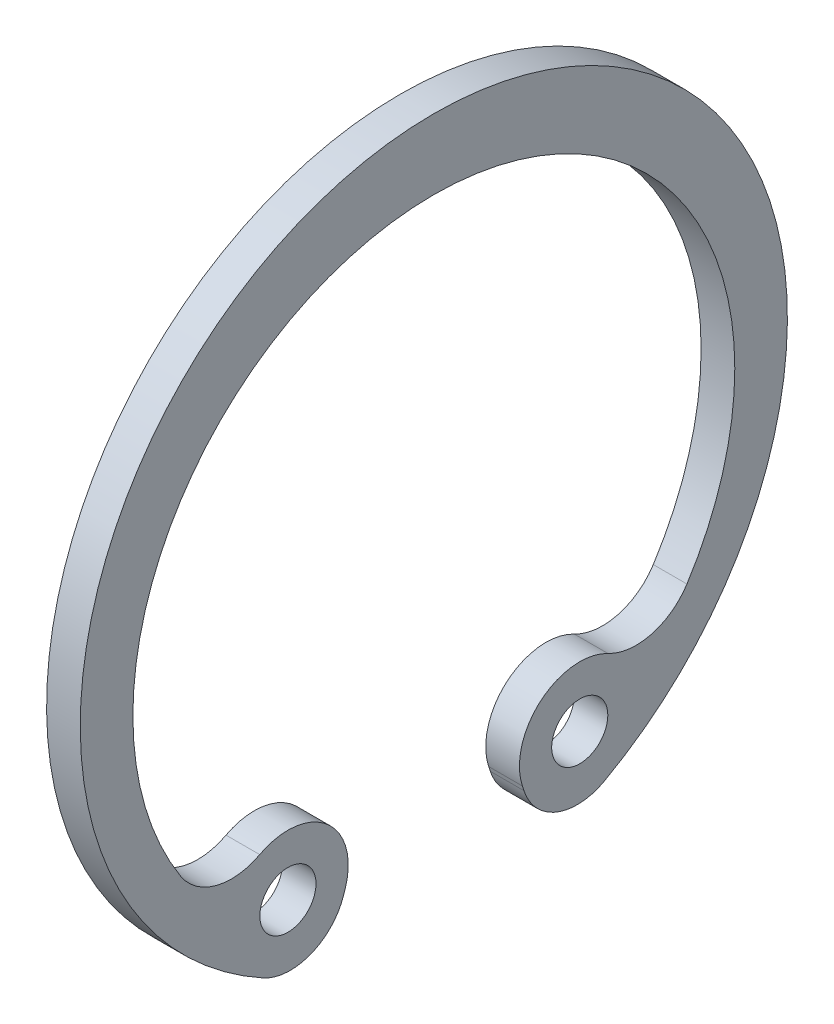
ISO-10303-21;
HEADER;
FILE_DESCRIPTION(('STEP AP214'),'2;1');
FILE_NAME('part.step','',(''),(''),'','','');
FILE_SCHEMA(('AUTOMOTIVE_DESIGN { 1 0 10303 214 1 1 1 1 }'));
ENDSEC;
DATA;
#1=APPLICATION_CONTEXT('core data for automotive mechanical design processes');
#2=APPLICATION_PROTOCOL_DEFINITION('international standard','automotive_design',2000,#1);
#3=PRODUCT_CONTEXT('',#1,'mechanical');
#4=PRODUCT('Part','Part','',(#3));
#5=PRODUCT_RELATED_PRODUCT_CATEGORY('part','',(#4));
#6=PRODUCT_DEFINITION_FORMATION('','',#4);
#7=PRODUCT_DEFINITION_CONTEXT('part definition',#1,'design');
#8=PRODUCT_DEFINITION('design','',#6,#7);
#9=PRODUCT_DEFINITION_SHAPE('','',#8);
#10=(LENGTH_UNIT() NAMED_UNIT(*) SI_UNIT(.MILLI.,.METRE.));
#11=(NAMED_UNIT(*) PLANE_ANGLE_UNIT() SI_UNIT($,.RADIAN.));
#12=(NAMED_UNIT(*) SI_UNIT($,.STERADIAN.) SOLID_ANGLE_UNIT());
#13=UNCERTAINTY_MEASURE_WITH_UNIT(LENGTH_MEASURE(1.E-05),#10,'distance_accuracy_value','');
#14=(GEOMETRIC_REPRESENTATION_CONTEXT(3) GLOBAL_UNCERTAINTY_ASSIGNED_CONTEXT((#13)) GLOBAL_UNIT_ASSIGNED_CONTEXT((#10,
#11,#12)) REPRESENTATION_CONTEXT('',''));
#15=CARTESIAN_POINT('',(0.,0.,0.));
#16=DIRECTION('',(0.,0.,1.));
#17=DIRECTION('',(1.,0.,0.));
#18=AXIS2_PLACEMENT_3D('',#15,#16,#17);
#19=CARTESIAN_POINT('',(-0.6,-9.28486852547096,-5.11382601040736));
#20=DIRECTION('',(1.,0.,0.));
#21=DIRECTION('',(0.,0.,-1.));
#22=AXIS2_PLACEMENT_3D('',#19,#20,#21);
#23=PLANE('',#22);
#24=DIRECTION('',(0.,-0.951223932313358,-0.308501265142158));
#25=VECTOR('',#24,1.);
#26=CARTESIAN_POINT('',(-0.6,-9.72763097883804,-3.15486854552626));
#27=LINE('',#26,#25);
#28=CARTESIAN_POINT('',(-0.6,-9.72763097883807,-3.15486854552627));
#29=VERTEX_POINT('',#28);
#30=CARTESIAN_POINT('',(-0.6,-9.90187105575525,-3.21137814578064));
#31=VERTEX_POINT('',#30);
#32=EDGE_CURVE('E90',#29,#31,#27,.T.);
#33=ORIENTED_EDGE('',*,*,#32,.F.);
#34=CARTESIAN_POINT('',(-0.6,-9.06435325878245,-5.2));
#35=DIRECTION('',(1.,0.,0.));
#36=DIRECTION('',(0.,0.,-1.));
#37=AXIS2_PLACEMENT_3D('',#34,#35,#36);
#38=CIRCLE('',#37,2.15);
#39=CARTESIAN_POINT('',(-0.6,-7.16418116422213,-6.20590556766242));
#40=VERTEX_POINT('',#39);
#41=EDGE_CURVE('E121',#40,#29,#38,.T.);
#42=ORIENTED_EDGE('',*,*,#41,.F.);
#43=CARTESIAN_POINT('',(-0.6,-5.26400906966182,-7.21181113532484));
#44=DIRECTION('',(1.,0.,0.));
#45=DIRECTION('',(0.,0.,-1.));
#46=AXIS2_PLACEMENT_3D('',#43,#44,#45);
#47=CIRCLE('',#46,2.15);
#48=CARTESIAN_POINT('',(-0.6,-6.42714253902309,-9.02002034126635));
#49=VERTEX_POINT('',#48);
#50=EDGE_CURVE('E124',#40,#49,#47,.T.);
#51=ORIENTED_EDGE('',*,*,#50,.T.);
#52=CARTESIAN_POINT('',(-0.6,-0.625000000000004,0.));
#53=DIRECTION('',(1.,0.,0.));
#54=DIRECTION('',(0.,0.,-1.));
#55=AXIS2_PLACEMENT_3D('',#52,#53,#54);
#56=CIRCLE('',#55,10.725);
#57=CARTESIAN_POINT('',(-0.6,-6.42714253902309,9.02002034126636));
#58=VERTEX_POINT('',#57);
#59=EDGE_CURVE('E125',#49,#58,#56,.T.);
#60=ORIENTED_EDGE('',*,*,#59,.T.);
#61=CARTESIAN_POINT('',(-0.6,-5.26400906966182,7.21181113532485));
#62=DIRECTION('',(1.,0.,0.));
#63=DIRECTION('',(0.,0.,-1.));
#64=AXIS2_PLACEMENT_3D('',#61,#62,#63);
#65=CIRCLE('',#64,2.15);
#66=CARTESIAN_POINT('',(-0.6,-7.16418117408161,6.20590558628714));
#67=VERTEX_POINT('',#66);
#68=EDGE_CURVE('E128',#58,#67,#65,.T.);
#69=ORIENTED_EDGE('',*,*,#68,.T.);
#70=CARTESIAN_POINT('',(-0.6,-9.06435325878245,5.2));
#71=DIRECTION('',(1.,0.,0.));
#72=DIRECTION('',(0.,0.,-1.));
#73=AXIS2_PLACEMENT_3D('',#70,#71,#72);
#74=CIRCLE('',#73,2.15);
#75=CARTESIAN_POINT('',(-0.6,-9.72763097883802,3.15486854552626));
#76=VERTEX_POINT('',#75);
#77=EDGE_CURVE('E134',#76,#67,#74,.T.);
#78=ORIENTED_EDGE('',*,*,#77,.F.);
#79=DIRECTION('',(0.,-0.951223932313369,0.308501265142123));
#80=VECTOR('',#79,1.);
#81=CARTESIAN_POINT('',(-0.6,-9.9018710557552,3.21137814578062));
#82=LINE('',#81,#80);
#83=CARTESIAN_POINT('',(-0.6,-9.9018710557552,3.21137814578062));
#84=VERTEX_POINT('',#83);
#85=EDGE_CURVE('E137',#76,#84,#82,.T.);
#86=ORIENTED_EDGE('',*,*,#85,.T.);
#87=CARTESIAN_POINT('',(-0.6,-9.28486852547096,5.11382601040736));
#88=DIRECTION('',(1.,0.,0.));
#89=DIRECTION('',(0.,0.,-1.));
#90=AXIS2_PLACEMENT_3D('',#87,#88,#89);
#91=CIRCLE('',#90,2.);
#92=CARTESIAN_POINT('',(-0.6,-11.0367305114089,6.07869884255969));
#93=VERTEX_POINT('',#92);
#94=EDGE_CURVE('E141',#93,#84,#91,.T.);
#95=ORIENTED_EDGE('',*,*,#94,.F.);
#96=CARTESIAN_POINT('',(-0.6,0.,0.));
#97=DIRECTION('',(1.,0.,0.));
#98=DIRECTION('',(0.,0.,-1.));
#99=AXIS2_PLACEMENT_3D('',#96,#97,#98);
#100=CIRCLE('',#99,12.6);
#101=CARTESIAN_POINT('',(-0.6,-11.0367304792593,-6.07869890093175));
#102=VERTEX_POINT('',#101);
#103=EDGE_CURVE('E102',#102,#93,#100,.T.);
#104=ORIENTED_EDGE('',*,*,#103,.F.);
#105=CARTESIAN_POINT('',(-0.6,-9.28486852547096,-5.11382601040736));
#106=DIRECTION('',(1.,0.,0.));
#107=DIRECTION('',(0.,0.,-1.));
#108=AXIS2_PLACEMENT_3D('',#105,#106,#107);
#109=CIRCLE('',#108,2.);
#110=EDGE_CURVE('E99',#31,#102,#109,.T.);
#111=ORIENTED_EDGE('',*,*,#110,.F.);
#112=EDGE_LOOP('',(#33,#42,#51,#60,#69,#78,#86,#95,#104,#111));
#113=FACE_BOUND('',#112,.T.);
#114=CARTESIAN_POINT('',(-0.6,-9.06435325878246,-5.2));
#115=DIRECTION('',(1.,0.,0.));
#116=DIRECTION('',(0.,0.,-1.));
#117=AXIS2_PLACEMENT_3D('',#114,#115,#116);
#118=CIRCLE('',#117,1.);
#119=CARTESIAN_POINT('',(-0.6,-9.06435325878246,-6.2));
#120=VERTEX_POINT('',#119);
#121=EDGE_CURVE('E105',#120,#120,#118,.T.);
#122=ORIENTED_EDGE('',*,*,#121,.T.);
#123=EDGE_LOOP('',(#122));
#124=FACE_BOUND('',#123,.T.);
#125=CARTESIAN_POINT('',(-0.6,-9.06435325878245,5.2));
#126=DIRECTION('',(1.,0.,0.));
#127=DIRECTION('',(0.,0.,-1.));
#128=AXIS2_PLACEMENT_3D('',#125,#126,#127);
#129=CIRCLE('',#128,1.);
#130=CARTESIAN_POINT('',(-0.6,-9.06435325878245,4.2));
#131=VERTEX_POINT('',#130);
#132=EDGE_CURVE('E19',#131,#131,#129,.T.);
#133=ORIENTED_EDGE('',*,*,#132,.T.);
#134=EDGE_LOOP('',(#133));
#135=FACE_BOUND('',#134,.T.);
#136=ADVANCED_FACE('F16',(#113,#124,#135),#23,.F.);
#137=CARTESIAN_POINT('',(0.6,-9.06435325878245,5.2));
#138=DIRECTION('',(1.,0.,0.));
#139=DIRECTION('',(0.,0.,-1.));
#140=AXIS2_PLACEMENT_3D('',#137,#138,#139);
#141=CYLINDRICAL_SURFACE('',#140,1.);
#142=ORIENTED_EDGE('',*,*,#132,.F.);
#143=EDGE_LOOP('',(#142));
#144=FACE_BOUND('',#143,.T.);
#145=CARTESIAN_POINT('',(0.6,-9.06435325878245,5.2));
#146=DIRECTION('',(1.,0.,0.));
#147=DIRECTION('',(0.,0.,-1.));
#148=AXIS2_PLACEMENT_3D('',#145,#146,#147);
#149=CIRCLE('',#148,1.);
#150=CARTESIAN_POINT('',(0.6,-9.06435325878245,4.2));
#151=VERTEX_POINT('',#150);
#152=EDGE_CURVE('E110',#151,#151,#149,.F.);
#153=ORIENTED_EDGE('',*,*,#152,.F.);
#154=EDGE_LOOP('',(#153));
#155=FACE_BOUND('',#154,.T.);
#156=ADVANCED_FACE('F185',(#144,#155),#141,.F.);
#157=CARTESIAN_POINT('',(0.6,-9.06435325878246,-5.2));
#158=DIRECTION('',(1.,0.,0.));
#159=DIRECTION('',(0.,0.,-1.));
#160=AXIS2_PLACEMENT_3D('',#157,#158,#159);
#161=CYLINDRICAL_SURFACE('',#160,1.);
#162=ORIENTED_EDGE('',*,*,#121,.F.);
#163=EDGE_LOOP('',(#162));
#164=FACE_BOUND('',#163,.T.);
#165=CARTESIAN_POINT('',(0.6,-9.06435325878246,-5.2));
#166=DIRECTION('',(1.,0.,0.));
#167=DIRECTION('',(0.,0.,-1.));
#168=AXIS2_PLACEMENT_3D('',#165,#166,#167);
#169=CIRCLE('',#168,1.);
#170=CARTESIAN_POINT('',(0.6,-9.06435325878246,-6.2));
#171=VERTEX_POINT('',#170);
#172=EDGE_CURVE('E113',#171,#171,#169,.F.);
#173=ORIENTED_EDGE('',*,*,#172,.F.);
#174=EDGE_LOOP('',(#173));
#175=FACE_BOUND('',#174,.T.);
#176=ADVANCED_FACE('F188',(#164,#175),#161,.F.);
#177=CARTESIAN_POINT('',(0.6,-9.28486852547096,-5.11382601040736));
#178=DIRECTION('',(1.,0.,0.));
#179=DIRECTION('',(0.,0.,-1.));
#180=AXIS2_PLACEMENT_3D('',#177,#178,#179);
#181=CYLINDRICAL_SURFACE('',#180,2.);
#182=CARTESIAN_POINT('',(0.6,-9.28486852547096,-5.11382601040736));
#183=DIRECTION('',(1.,0.,0.));
#184=DIRECTION('',(0.,0.,-1.));
#185=AXIS2_PLACEMENT_3D('',#182,#183,#184);
#186=CIRCLE('',#185,2.);
#187=CARTESIAN_POINT('',(0.6,-9.90187105575525,-3.21137814578064));
#188=VERTEX_POINT('',#187);
#189=CARTESIAN_POINT('',(0.6,-11.0367304792593,-6.07869890093175));
#190=VERTEX_POINT('',#189);
#191=EDGE_CURVE('E109',#188,#190,#186,.T.);
#192=ORIENTED_EDGE('',*,*,#191,.F.);
#193=DIRECTION('',(1.,0.,0.));
#194=VECTOR('',#193,1.);
#195=CARTESIAN_POINT('',(0.6,-9.90187105575522,-3.21137814578062));
#196=LINE('',#195,#194);
#197=EDGE_CURVE('E94',#188,#31,#196,.F.);
#198=ORIENTED_EDGE('',*,*,#197,.T.);
#199=ORIENTED_EDGE('',*,*,#110,.T.);
#200=DIRECTION('',(1.,0.,0.));
#201=VECTOR('',#200,1.);
#202=CARTESIAN_POINT('',(0.6,-11.0367304471097,-6.07869895930381));
#203=LINE('',#202,#201);
#204=EDGE_CURVE('E142',#190,#102,#203,.F.);
#205=ORIENTED_EDGE('',*,*,#204,.F.);
#206=EDGE_LOOP('',(#192,#198,#199,#205));
#207=FACE_BOUND('',#206,.T.);
#208=ADVANCED_FACE('F107',(#207),#181,.T.);
#209=CARTESIAN_POINT('',(0.6,0.,0.));
#210=DIRECTION('',(1.,0.,0.));
#211=DIRECTION('',(0.,0.,-1.));
#212=AXIS2_PLACEMENT_3D('',#209,#210,#211);
#213=CYLINDRICAL_SURFACE('',#212,12.6);
#214=CARTESIAN_POINT('',(0.6,0.,0.));
#215=DIRECTION('',(1.,0.,0.));
#216=DIRECTION('',(0.,0.,-1.));
#217=AXIS2_PLACEMENT_3D('',#214,#215,#216);
#218=CIRCLE('',#217,12.6);
#219=CARTESIAN_POINT('',(0.6,-11.0367305114089,6.07869884255969));
#220=VERTEX_POINT('',#219);
#221=EDGE_CURVE('E164',#190,#220,#218,.T.);
#222=ORIENTED_EDGE('',*,*,#221,.F.);
#223=ORIENTED_EDGE('',*,*,#204,.T.);
#224=ORIENTED_EDGE('',*,*,#103,.T.);
#225=DIRECTION('',(1.,0.,0.));
#226=VECTOR('',#225,1.);
#227=CARTESIAN_POINT('',(0.6,-11.0367305114089,6.07869884255968));
#228=LINE('',#227,#226);
#229=EDGE_CURVE('E138',#220,#93,#228,.F.);
#230=ORIENTED_EDGE('',*,*,#229,.F.);
#231=EDGE_LOOP('',(#222,#223,#224,#230));
#232=FACE_BOUND('',#231,.T.);
#233=ADVANCED_FACE('F228',(#232),#213,.T.);
#234=CARTESIAN_POINT('',(0.6,-9.28486852547096,5.11382601040736));
#235=DIRECTION('',(1.,0.,0.));
#236=DIRECTION('',(0.,0.,-1.));
#237=AXIS2_PLACEMENT_3D('',#234,#235,#236);
#238=CYLINDRICAL_SURFACE('',#237,2.);
#239=CARTESIAN_POINT('',(0.6,-9.28486852547096,5.11382601040736));
#240=DIRECTION('',(1.,0.,0.));
#241=DIRECTION('',(0.,0.,-1.));
#242=AXIS2_PLACEMENT_3D('',#239,#240,#241);
#243=CIRCLE('',#242,2.);
#244=CARTESIAN_POINT('',(0.6,-9.90187105575519,3.21137814578062));
#245=VERTEX_POINT('',#244);
#246=EDGE_CURVE('E161',#220,#245,#243,.T.);
#247=ORIENTED_EDGE('',*,*,#246,.F.);
#248=ORIENTED_EDGE('',*,*,#229,.T.);
#249=ORIENTED_EDGE('',*,*,#94,.T.);
#250=DIRECTION('',(1.,0.,0.));
#251=VECTOR('',#250,1.);
#252=CARTESIAN_POINT('',(0.6,-9.9018710557552,3.21137814578062));
#253=LINE('',#252,#251);
#254=EDGE_CURVE('E135',#84,#245,#253,.T.);
#255=ORIENTED_EDGE('',*,*,#254,.T.);
#256=EDGE_LOOP('',(#247,#248,#249,#255));
#257=FACE_BOUND('',#256,.T.);
#258=ADVANCED_FACE('F224',(#257),#238,.T.);
#259=CARTESIAN_POINT('',(0.6,-9.9018710557552,3.21137814578062));
#260=DIRECTION('',(0.,0.308501265142123,0.951223932313369));
#261=DIRECTION('',(0.,-0.951223932313369,0.308501265142123));
#262=AXIS2_PLACEMENT_3D('',#259,#260,#261);
#263=PLANE('',#262);
#264=DIRECTION('',(1.,0.,0.));
#265=VECTOR('',#264,1.);
#266=CARTESIAN_POINT('',(0.6,-9.72763097883802,3.15486854552626));
#267=LINE('',#266,#265);
#268=CARTESIAN_POINT('',(0.6,-9.727630978838,3.15486854552626));
#269=VERTEX_POINT('',#268);
#270=EDGE_CURVE('E131',#269,#76,#267,.F.);
#271=ORIENTED_EDGE('',*,*,#270,.F.);
#272=DIRECTION('',(0.,0.951223932313373,-0.308501265142112));
#273=VECTOR('',#272,1.);
#274=CARTESIAN_POINT('',(0.6,-9.9018710557552,3.21137814578062));
#275=LINE('',#274,#273);
#276=EDGE_CURVE('E160',#245,#269,#275,.T.);
#277=ORIENTED_EDGE('',*,*,#276,.F.);
#278=ORIENTED_EDGE('',*,*,#254,.F.);
#279=ORIENTED_EDGE('',*,*,#85,.F.);
#280=EDGE_LOOP('',(#271,#277,#278,#279));
#281=FACE_BOUND('',#280,.T.);
#282=ADVANCED_FACE('F220',(#281),#263,.F.);
#283=CARTESIAN_POINT('',(0.6,-9.06435325878245,5.2));
#284=DIRECTION('',(1.,0.,0.));
#285=DIRECTION('',(0.,0.,-1.));
#286=AXIS2_PLACEMENT_3D('',#283,#284,#285);
#287=CYLINDRICAL_SURFACE('',#286,2.15);
#288=CARTESIAN_POINT('',(0.6,-9.06435325878245,5.2));
#289=DIRECTION('',(1.,0.,0.));
#290=DIRECTION('',(0.,0.,-1.));
#291=AXIS2_PLACEMENT_3D('',#288,#289,#290);
#292=CIRCLE('',#291,2.15);
#293=CARTESIAN_POINT('',(0.6,-7.16418117408161,6.20590558628714));
#294=VERTEX_POINT('',#293);
#295=EDGE_CURVE('E157',#269,#294,#292,.T.);
#296=ORIENTED_EDGE('',*,*,#295,.F.);
#297=ORIENTED_EDGE('',*,*,#270,.T.);
#298=ORIENTED_EDGE('',*,*,#77,.T.);
#299=DIRECTION('',(1.,0.,0.));
#300=VECTOR('',#299,1.);
#301=CARTESIAN_POINT('',(0.6,-7.16418118394109,6.20590560491185));
#302=LINE('',#301,#300);
#303=EDGE_CURVE('E129',#67,#294,#302,.T.);
#304=ORIENTED_EDGE('',*,*,#303,.T.);
#305=EDGE_LOOP('',(#296,#297,#298,#304));
#306=FACE_BOUND('',#305,.T.);
#307=ADVANCED_FACE('F216',(#306),#287,.T.);
#308=CARTESIAN_POINT('',(0.6,-5.26400906966182,7.21181113532485));
#309=DIRECTION('',(1.,0.,0.));
#310=DIRECTION('',(0.,0.,-1.));
#311=AXIS2_PLACEMENT_3D('',#308,#309,#310);
#312=CYLINDRICAL_SURFACE('',#311,2.15);
#313=DIRECTION('',(1.,0.,0.));
#314=VECTOR('',#313,1.);
#315=CARTESIAN_POINT('',(0.6,-6.42714253902309,9.02002034126635));
#316=LINE('',#315,#314);
#317=CARTESIAN_POINT('',(0.6,-6.42714253902309,9.02002034126635));
#318=VERTEX_POINT('',#317);
#319=EDGE_CURVE('E126',#58,#318,#316,.T.);
#320=ORIENTED_EDGE('',*,*,#319,.T.);
#321=CARTESIAN_POINT('',(0.6,-5.26400906966182,7.21181113532485));
#322=DIRECTION('',(1.,0.,0.));
#323=DIRECTION('',(0.,0.,-1.));
#324=AXIS2_PLACEMENT_3D('',#321,#322,#323);
#325=CIRCLE('',#324,2.15);
#326=EDGE_CURVE('E154',#294,#318,#325,.F.);
#327=ORIENTED_EDGE('',*,*,#326,.F.);
#328=ORIENTED_EDGE('',*,*,#303,.F.);
#329=ORIENTED_EDGE('',*,*,#68,.F.);
#330=EDGE_LOOP('',(#320,#327,#328,#329));
#331=FACE_BOUND('',#330,.T.);
#332=ADVANCED_FACE('F212',(#331),#312,.F.);
#333=CARTESIAN_POINT('',(0.6,-0.625000000000004,0.));
#334=DIRECTION('',(1.,0.,0.));
#335=DIRECTION('',(0.,0.,-1.));
#336=AXIS2_PLACEMENT_3D('',#333,#334,#335);
#337=CYLINDRICAL_SURFACE('',#336,10.725);
#338=DIRECTION('',(1.,0.,0.));
#339=VECTOR('',#338,1.);
#340=CARTESIAN_POINT('',(0.6,-6.4271425390231,-9.02002034126634));
#341=LINE('',#340,#339);
#342=CARTESIAN_POINT('',(0.6,-6.42714253902309,-9.02002034126635));
#343=VERTEX_POINT('',#342);
#344=EDGE_CURVE('E122',#49,#343,#341,.T.);
#345=ORIENTED_EDGE('',*,*,#344,.T.);
#346=CARTESIAN_POINT('',(0.6,-0.625000000000004,0.));
#347=DIRECTION('',(1.,0.,0.));
#348=DIRECTION('',(0.,0.,-1.));
#349=AXIS2_PLACEMENT_3D('',#346,#347,#348);
#350=CIRCLE('',#349,10.725);
#351=EDGE_CURVE('E151',#318,#343,#350,.F.);
#352=ORIENTED_EDGE('',*,*,#351,.F.);
#353=ORIENTED_EDGE('',*,*,#319,.F.);
#354=ORIENTED_EDGE('',*,*,#59,.F.);
#355=EDGE_LOOP('',(#345,#352,#353,#354));
#356=FACE_BOUND('',#355,.T.);
#357=ADVANCED_FACE('F208',(#356),#337,.F.);
#358=CARTESIAN_POINT('',(0.6,-5.26400906966182,-7.21181113532484));
#359=DIRECTION('',(1.,0.,0.));
#360=DIRECTION('',(0.,0.,-1.));
#361=AXIS2_PLACEMENT_3D('',#358,#359,#360);
#362=CYLINDRICAL_SURFACE('',#361,2.15);
#363=DIRECTION('',(1.,0.,0.));
#364=VECTOR('',#363,1.);
#365=CARTESIAN_POINT('',(0.6,-7.16418116422213,-6.20590556766242));
#366=LINE('',#365,#364);
#367=CARTESIAN_POINT('',(0.6,-7.16418116422213,-6.20590556766242));
#368=VERTEX_POINT('',#367);
#369=EDGE_CURVE('E115',#368,#40,#366,.F.);
#370=ORIENTED_EDGE('',*,*,#369,.F.);
#371=CARTESIAN_POINT('',(0.6,-5.26400906966182,-7.21181113532484));
#372=DIRECTION('',(1.,0.,0.));
#373=DIRECTION('',(0.,0.,-1.));
#374=AXIS2_PLACEMENT_3D('',#371,#372,#373);
#375=CIRCLE('',#374,2.15);
#376=EDGE_CURVE('E148',#343,#368,#375,.F.);
#377=ORIENTED_EDGE('',*,*,#376,.F.);
#378=ORIENTED_EDGE('',*,*,#344,.F.);
#379=ORIENTED_EDGE('',*,*,#50,.F.);
#380=EDGE_LOOP('',(#370,#377,#378,#379));
#381=FACE_BOUND('',#380,.T.);
#382=ADVANCED_FACE('F205',(#381),#362,.F.);
#383=CARTESIAN_POINT('',(0.6,-9.06435325878245,-5.2));
#384=DIRECTION('',(1.,0.,0.));
#385=DIRECTION('',(0.,0.,-1.));
#386=AXIS2_PLACEMENT_3D('',#383,#384,#385);
#387=CYLINDRICAL_SURFACE('',#386,2.15);
#388=CARTESIAN_POINT('',(0.6,-9.06435325878245,-5.2));
#389=DIRECTION('',(1.,0.,0.));
#390=DIRECTION('',(0.,0.,-1.));
#391=AXIS2_PLACEMENT_3D('',#388,#389,#390);
#392=CIRCLE('',#391,2.15);
#393=CARTESIAN_POINT('',(0.6,-9.72763097883807,-3.15486854552627));
#394=VERTEX_POINT('',#393);
#395=EDGE_CURVE('E25',#368,#394,#392,.T.);
#396=ORIENTED_EDGE('',*,*,#395,.F.);
#397=ORIENTED_EDGE('',*,*,#369,.T.);
#398=ORIENTED_EDGE('',*,*,#41,.T.);
#399=DIRECTION('',(1.,0.,0.));
#400=VECTOR('',#399,1.);
#401=CARTESIAN_POINT('',(0.6,-9.72763097883804,-3.15486854552626));
#402=LINE('',#401,#400);
#403=EDGE_CURVE('E34',#29,#394,#402,.T.);
#404=ORIENTED_EDGE('',*,*,#403,.T.);
#405=EDGE_LOOP('',(#396,#397,#398,#404));
#406=FACE_BOUND('',#405,.T.);
#407=ADVANCED_FACE('F199',(#406),#387,.T.);
#408=CARTESIAN_POINT('',(0.6,-9.72763097883804,-3.15486854552626));
#409=DIRECTION('',(0.,0.308501265142128,-0.951223932313368));
#410=DIRECTION('',(0.,0.951223932313368,0.308501265142128));
#411=AXIS2_PLACEMENT_3D('',#408,#409,#410);
#412=PLANE('',#411);
#413=ORIENTED_EDGE('',*,*,#197,.F.);
#414=DIRECTION('',(0.,-0.951223932313358,-0.308501265142158));
#415=VECTOR('',#414,1.);
#416=CARTESIAN_POINT('',(0.6,-9.72763097883804,-3.15486854552626));
#417=LINE('',#416,#415);
#418=EDGE_CURVE('E11',#394,#188,#417,.T.);
#419=ORIENTED_EDGE('',*,*,#418,.F.);
#420=ORIENTED_EDGE('',*,*,#403,.F.);
#421=ORIENTED_EDGE('',*,*,#32,.T.);
#422=EDGE_LOOP('',(#413,#419,#420,#421));
#423=FACE_BOUND('',#422,.T.);
#424=ADVANCED_FACE('F92',(#423),#412,.F.);
#425=CARTESIAN_POINT('',(0.6,-9.28486852547096,-5.11382601040736));
#426=DIRECTION('',(1.,0.,0.));
#427=DIRECTION('',(0.,0.,-1.));
#428=AXIS2_PLACEMENT_3D('',#425,#426,#427);
#429=PLANE('',#428);
#430=ORIENTED_EDGE('',*,*,#395,.T.);
#431=ORIENTED_EDGE('',*,*,#418,.T.);
#432=ORIENTED_EDGE('',*,*,#191,.T.);
#433=ORIENTED_EDGE('',*,*,#221,.T.);
#434=ORIENTED_EDGE('',*,*,#246,.T.);
#435=ORIENTED_EDGE('',*,*,#276,.T.);
#436=ORIENTED_EDGE('',*,*,#295,.T.);
#437=ORIENTED_EDGE('',*,*,#326,.T.);
#438=ORIENTED_EDGE('',*,*,#351,.T.);
#439=ORIENTED_EDGE('',*,*,#376,.T.);
#440=EDGE_LOOP('',(#430,#431,#432,#433,#434,#435,#436,#437,#438,#439));
#441=FACE_BOUND('',#440,.T.);
#442=ORIENTED_EDGE('',*,*,#172,.T.);
#443=EDGE_LOOP('',(#442));
#444=FACE_BOUND('',#443,.T.);
#445=ORIENTED_EDGE('',*,*,#152,.T.);
#446=EDGE_LOOP('',(#445));
#447=FACE_BOUND('',#446,.T.);
#448=ADVANCED_FACE('F191',(#441,#444,#447),#429,.T.);
#449=CLOSED_SHELL('',(#136,#156,#176,#208,#233,#258,#282,#307,#332,#357,#382,#407,#424,#448));
#450=MANIFOLD_SOLID_BREP('B1',#449);
#451=ADVANCED_BREP_SHAPE_REPRESENTATION('',(#18,#450),#14);
#452=SHAPE_DEFINITION_REPRESENTATION(#9,#451);
ENDSEC;
END-ISO-10303-21;
